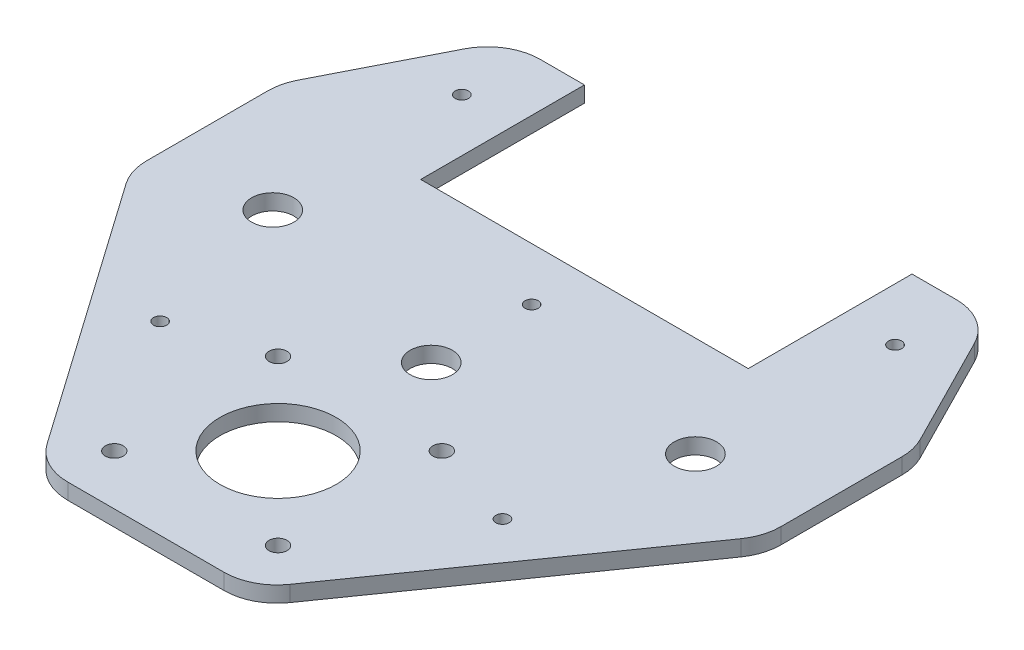
ISO-10303-21;
HEADER;
FILE_DESCRIPTION(('STEP AP214'),'2;1');
FILE_NAME('part.step','',(''),(''),'','','');
FILE_SCHEMA(('AUTOMOTIVE_DESIGN { 1 0 10303 214 1 1 1 1 }'));
ENDSEC;
DATA;
#1=APPLICATION_CONTEXT('core data for automotive mechanical design processes');
#2=APPLICATION_PROTOCOL_DEFINITION('international standard','automotive_design',2000,#1);
#3=PRODUCT_CONTEXT('',#1,'mechanical');
#4=PRODUCT('Part','Part','',(#3));
#5=PRODUCT_RELATED_PRODUCT_CATEGORY('part','',(#4));
#6=PRODUCT_DEFINITION_FORMATION('','',#4);
#7=PRODUCT_DEFINITION_CONTEXT('part definition',#1,'design');
#8=PRODUCT_DEFINITION('design','',#6,#7);
#9=PRODUCT_DEFINITION_SHAPE('','',#8);
#10=(LENGTH_UNIT() NAMED_UNIT(*) SI_UNIT(.MILLI.,.METRE.));
#11=(NAMED_UNIT(*) PLANE_ANGLE_UNIT() SI_UNIT($,.RADIAN.));
#12=(NAMED_UNIT(*) SI_UNIT($,.STERADIAN.) SOLID_ANGLE_UNIT());
#13=UNCERTAINTY_MEASURE_WITH_UNIT(LENGTH_MEASURE(1.E-05),#10,'distance_accuracy_value','');
#14=(GEOMETRIC_REPRESENTATION_CONTEXT(3) GLOBAL_UNCERTAINTY_ASSIGNED_CONTEXT((#13)) GLOBAL_UNIT_ASSIGNED_CONTEXT((#10,
#11,#12)) REPRESENTATION_CONTEXT('',''));
#15=CARTESIAN_POINT('',(0.,0.,0.));
#16=DIRECTION('',(0.,0.,1.));
#17=DIRECTION('',(1.,0.,0.));
#18=AXIS2_PLACEMENT_3D('',#15,#16,#17);
#19=CARTESIAN_POINT('',(0.,3.,0.));
#20=DIRECTION('',(0.,-1.,0.));
#21=DIRECTION('',(0.,0.,-1.));
#22=AXIS2_PLACEMENT_3D('',#19,#20,#21);
#23=PLANE('',#22);
#24=CARTESIAN_POINT('',(32.4004595233145,3.,28.9206548207232));
#25=DIRECTION('',(0.,1.,0.));
#26=DIRECTION('',(0.,0.,1.));
#27=AXIS2_PLACEMENT_3D('',#24,#25,#26);
#28=CIRCLE('',#27,1.25);
#29=CARTESIAN_POINT('',(32.4004595233145,3.,30.1706548207232));
#30=VERTEX_POINT('',#29);
#31=EDGE_CURVE('E427',#30,#30,#28,.T.);
#32=ORIENTED_EDGE('',*,*,#31,.F.);
#33=EDGE_LOOP('',(#32));
#34=FACE_BOUND('',#33,.T.);
#35=CARTESIAN_POINT('',(0.,3.,-9.00000000000001));
#36=DIRECTION('',(0.,1.,0.));
#37=DIRECTION('',(0.,0.,1.));
#38=AXIS2_PLACEMENT_3D('',#35,#36,#37);
#39=CIRCLE('',#38,1.25);
#40=CARTESIAN_POINT('',(0.,3.,-7.75000000000001));
#41=VERTEX_POINT('',#40);
#42=EDGE_CURVE('E421',#41,#41,#39,.T.);
#43=ORIENTED_EDGE('',*,*,#42,.F.);
#44=EDGE_LOOP('',(#43));
#45=FACE_BOUND('',#44,.T.);
#46=CARTESIAN_POINT('',(-41.,3.,-36.7920317857662));
#47=DIRECTION('',(0.,1.,0.));
#48=DIRECTION('',(0.,0.,1.));
#49=AXIS2_PLACEMENT_3D('',#46,#47,#48);
#50=CIRCLE('',#49,1.25);
#51=CARTESIAN_POINT('',(-41.,3.,-35.5420317857662));
#52=VERTEX_POINT('',#51);
#53=EDGE_CURVE('E415',#52,#52,#50,.T.);
#54=ORIENTED_EDGE('',*,*,#53,.F.);
#55=EDGE_LOOP('',(#54));
#56=FACE_BOUND('',#55,.T.);
#57=CARTESIAN_POINT('',(41.,3.,-36.7920317857662));
#58=DIRECTION('',(0.,1.,0.));
#59=DIRECTION('',(0.,0.,1.));
#60=AXIS2_PLACEMENT_3D('',#57,#58,#59);
#61=CIRCLE('',#60,1.25555555555556);
#62=CARTESIAN_POINT('',(41.,3.,-35.5364762302107));
#63=VERTEX_POINT('',#62);
#64=EDGE_CURVE('E409',#63,#63,#61,.T.);
#65=ORIENTED_EDGE('',*,*,#64,.F.);
#66=EDGE_LOOP('',(#65));
#67=FACE_BOUND('',#66,.T.);
#68=CARTESIAN_POINT('',(-32.4004595233145,3.,28.9206548207232));
#69=DIRECTION('',(0.,1.,0.));
#70=DIRECTION('',(0.,0.,1.));
#71=AXIS2_PLACEMENT_3D('',#68,#69,#70);
#72=CIRCLE('',#71,1.25);
#73=CARTESIAN_POINT('',(-32.4004595233145,3.,30.1706548207232));
#74=VERTEX_POINT('',#73);
#75=EDGE_CURVE('E403',#74,#74,#72,.T.);
#76=ORIENTED_EDGE('',*,*,#75,.F.);
#77=EDGE_LOOP('',(#76));
#78=FACE_BOUND('',#77,.T.);
#79=DIRECTION('',(-1.,0.,0.));
#80=VECTOR('',#79,1.);
#81=CARTESIAN_POINT('',(-31.,3.,-50.));
#82=LINE('',#81,#80);
#83=CARTESIAN_POINT('',(-31.,3.,-50.));
#84=VERTEX_POINT('',#83);
#85=CARTESIAN_POINT('',(-39.3678758208284,3.,-50.));
#86=VERTEX_POINT('',#85);
#87=EDGE_CURVE('E237',#84,#86,#82,.T.);
#88=ORIENTED_EDGE('',*,*,#87,.T.);
#89=CARTESIAN_POINT('',(-39.3678758208284,3.,-40.));
#90=DIRECTION('',(0.,-1.,0.));
#91=DIRECTION('',(0.,0.,-1.));
#92=AXIS2_PLACEMENT_3D('',#89,#90,#91);
#93=CIRCLE('',#92,10.);
#94=CARTESIAN_POINT('',(-48.2806561284393,3.,-44.5345724372055));
#95=VERTEX_POINT('',#94);
#96=EDGE_CURVE('E279',#86,#95,#93,.F.);
#97=ORIENTED_EDGE('',*,*,#96,.T.);
#98=DIRECTION('',(-0.453457243720553,0.,0.891278030761086));
#99=VECTOR('',#98,1.);
#100=CARTESIAN_POINT('',(-60.,3.,-21.5));
#101=LINE('',#100,#99);
#102=CARTESIAN_POINT('',(-58.9127803076108,3.,-23.636949050558));
#103=VERTEX_POINT('',#102);
#104=EDGE_CURVE('E351',#95,#103,#101,.T.);
#105=ORIENTED_EDGE('',*,*,#104,.T.);
#106=CARTESIAN_POINT('',(-50.,3.,-19.1023766133524));
#107=DIRECTION('',(0.,-1.,0.));
#108=DIRECTION('',(0.,0.,-1.));
#109=AXIS2_PLACEMENT_3D('',#106,#107,#108);
#110=CIRCLE('',#109,10.);
#111=CARTESIAN_POINT('',(-60.,3.,-19.1023766133524));
#112=VERTEX_POINT('',#111);
#113=EDGE_CURVE('E277',#103,#112,#110,.F.);
#114=ORIENTED_EDGE('',*,*,#113,.T.);
#115=DIRECTION('',(0.,0.,1.));
#116=VECTOR('',#115,1.);
#117=CARTESIAN_POINT('',(-60.,3.,7.00000000000001));
#118=LINE('',#117,#116);
#119=CARTESIAN_POINT('',(-60.,3.,3.84130964144633));
#120=VERTEX_POINT('',#119);
#121=EDGE_CURVE('E348',#112,#120,#118,.T.);
#122=ORIENTED_EDGE('',*,*,#121,.T.);
#123=CARTESIAN_POINT('',(-50.,3.,3.84130964144633));
#124=DIRECTION('',(0.,-1.,0.));
#125=DIRECTION('',(0.,0.,-1.));
#126=AXIS2_PLACEMENT_3D('',#123,#124,#125);
#127=CIRCLE('',#126,10.);
#128=CARTESIAN_POINT('',(-58.1855669246241,3.,9.58556713241063));
#129=VERTEX_POINT('',#128);
#130=EDGE_CURVE('E275',#120,#129,#127,.F.);
#131=ORIENTED_EDGE('',*,*,#130,.T.);
#132=DIRECTION('',(0.57442574909643,0.,0.818556692462413));
#133=VECTOR('',#132,1.);
#134=CARTESIAN_POINT('',(-60.,3.,7.00000000000001));
#135=LINE('',#134,#133);
#136=CARTESIAN_POINT('',(-22.9864859712531,3.,59.7442574909643));
#137=VERTEX_POINT('',#136);
#138=EDGE_CURVE('E321',#129,#137,#135,.T.);
#139=ORIENTED_EDGE('',*,*,#138,.T.);
#140=CARTESIAN_POINT('',(-14.800919046629,3.,54.));
#141=DIRECTION('',(0.,-1.,0.));
#142=DIRECTION('',(0.,0.,-1.));
#143=AXIS2_PLACEMENT_3D('',#140,#141,#142);
#144=CIRCLE('',#143,10.);
#145=CARTESIAN_POINT('',(-14.800919046629,3.,64.));
#146=VERTEX_POINT('',#145);
#147=EDGE_CURVE('E268',#137,#146,#144,.F.);
#148=ORIENTED_EDGE('',*,*,#147,.T.);
#149=DIRECTION('',(1.,0.,0.));
#150=VECTOR('',#149,1.);
#151=CARTESIAN_POINT('',(20.,3.,64.));
#152=LINE('',#151,#150);
#153=CARTESIAN_POINT('',(14.800919046629,3.,64.));
#154=VERTEX_POINT('',#153);
#155=EDGE_CURVE('E311',#146,#154,#152,.T.);
#156=ORIENTED_EDGE('',*,*,#155,.T.);
#157=CARTESIAN_POINT('',(14.800919046629,3.,54.));
#158=DIRECTION('',(0.,-1.,0.));
#159=DIRECTION('',(0.,0.,-1.));
#160=AXIS2_PLACEMENT_3D('',#157,#158,#159);
#161=CIRCLE('',#160,10.);
#162=CARTESIAN_POINT('',(22.9864859712531,3.,59.7442574909643));
#163=VERTEX_POINT('',#162);
#164=EDGE_CURVE('E266',#154,#163,#161,.F.);
#165=ORIENTED_EDGE('',*,*,#164,.T.);
#166=DIRECTION('',(0.57442574909643,0.,-0.818556692462413));
#167=VECTOR('',#166,1.);
#168=CARTESIAN_POINT('',(20.,3.,64.));
#169=LINE('',#168,#167);
#170=CARTESIAN_POINT('',(58.1855669246241,3.,9.58556713241062));
#171=VERTEX_POINT('',#170);
#172=EDGE_CURVE('E320',#163,#171,#169,.T.);
#173=ORIENTED_EDGE('',*,*,#172,.T.);
#174=CARTESIAN_POINT('',(50.,3.,3.84130964144631));
#175=DIRECTION('',(0.,-1.,0.));
#176=DIRECTION('',(0.,0.,-1.));
#177=AXIS2_PLACEMENT_3D('',#174,#175,#176);
#178=CIRCLE('',#177,10.);
#179=CARTESIAN_POINT('',(60.,3.,3.84130964144631));
#180=VERTEX_POINT('',#179);
#181=EDGE_CURVE('E270',#171,#180,#178,.F.);
#182=ORIENTED_EDGE('',*,*,#181,.T.);
#183=DIRECTION('',(0.,0.,-1.));
#184=VECTOR('',#183,1.);
#185=CARTESIAN_POINT('',(60.,3.,7.00000000000001));
#186=LINE('',#185,#184);
#187=CARTESIAN_POINT('',(60.,3.,-19.1023766133524));
#188=VERTEX_POINT('',#187);
#189=EDGE_CURVE('E342',#180,#188,#186,.T.);
#190=ORIENTED_EDGE('',*,*,#189,.T.);
#191=CARTESIAN_POINT('',(50.,3.,-19.1023766133524));
#192=DIRECTION('',(0.,-1.,0.));
#193=DIRECTION('',(0.,0.,-1.));
#194=AXIS2_PLACEMENT_3D('',#191,#192,#193);
#195=CIRCLE('',#194,10.);
#196=CARTESIAN_POINT('',(58.9127803076109,3.,-23.636949050558));
#197=VERTEX_POINT('',#196);
#198=EDGE_CURVE('E272',#188,#197,#195,.F.);
#199=ORIENTED_EDGE('',*,*,#198,.T.);
#200=DIRECTION('',(-0.453457243720553,0.,-0.891278030761086));
#201=VECTOR('',#200,1.);
#202=CARTESIAN_POINT('',(45.5,3.,-50.));
#203=LINE('',#202,#201);
#204=CARTESIAN_POINT('',(48.2806561284393,3.,-44.5345724372055));
#205=VERTEX_POINT('',#204);
#206=EDGE_CURVE('E183',#197,#205,#203,.T.);
#207=ORIENTED_EDGE('',*,*,#206,.T.);
#208=CARTESIAN_POINT('',(39.3678758208284,3.,-40.));
#209=DIRECTION('',(0.,-1.,0.));
#210=DIRECTION('',(0.,0.,-1.));
#211=AXIS2_PLACEMENT_3D('',#208,#209,#210);
#212=CIRCLE('',#211,10.);
#213=CARTESIAN_POINT('',(39.3678758208284,3.,-50.));
#214=VERTEX_POINT('',#213);
#215=EDGE_CURVE('E52',#205,#214,#212,.F.);
#216=ORIENTED_EDGE('',*,*,#215,.T.);
#217=DIRECTION('',(-1.,0.,0.));
#218=VECTOR('',#217,1.);
#219=CARTESIAN_POINT('',(45.5,3.,-50.));
#220=LINE('',#219,#218);
#221=CARTESIAN_POINT('',(31.,3.,-50.));
#222=VERTEX_POINT('',#221);
#223=EDGE_CURVE('E173',#214,#222,#220,.T.);
#224=ORIENTED_EDGE('',*,*,#223,.T.);
#225=DIRECTION('',(0.,0.,1.));
#226=VECTOR('',#225,1.);
#227=CARTESIAN_POINT('',(31.,3.,-50.));
#228=LINE('',#227,#226);
#229=CARTESIAN_POINT('',(31.,3.,-19.));
#230=VERTEX_POINT('',#229);
#231=EDGE_CURVE('E178',#222,#230,#228,.T.);
#232=ORIENTED_EDGE('',*,*,#231,.T.);
#233=DIRECTION('',(-1.,0.,0.));
#234=VECTOR('',#233,1.);
#235=CARTESIAN_POINT('',(31.,3.,-19.));
#236=LINE('',#235,#234);
#237=CARTESIAN_POINT('',(-31.,3.,-19.));
#238=VERTEX_POINT('',#237);
#239=EDGE_CURVE('E198',#230,#238,#236,.T.);
#240=ORIENTED_EDGE('',*,*,#239,.T.);
#241=DIRECTION('',(0.,0.,-1.));
#242=VECTOR('',#241,1.);
#243=CARTESIAN_POINT('',(-31.,3.,-50.));
#244=LINE('',#243,#242);
#245=EDGE_CURVE('E200',#238,#84,#244,.T.);
#246=ORIENTED_EDGE('',*,*,#245,.T.);
#247=EDGE_LOOP('',(#88,#97,#105,#114,#122,#131,#139,#148,#156,#165,#173,#182,#190,#199,#207,
#216,#224,#232,#240,#246));
#248=FACE_BOUND('',#247,.T.);
#249=CARTESIAN_POINT('',(0.,3.,39.));
#250=DIRECTION('',(0.,1.,0.));
#251=DIRECTION('',(0.,0.,1.));
#252=AXIS2_PLACEMENT_3D('',#249,#250,#251);
#253=CIRCLE('',#252,11.);
#254=CARTESIAN_POINT('',(0.,3.,50.));
#255=VERTEX_POINT('',#254);
#256=EDGE_CURVE('E210',#255,#255,#253,.T.);
#257=ORIENTED_EDGE('',*,*,#256,.F.);
#258=EDGE_LOOP('',(#257));
#259=FACE_BOUND('',#258,.T.);
#260=CARTESIAN_POINT('',(0.,3.,9.99999999999999));
#261=DIRECTION('',(0.,1.,0.));
#262=DIRECTION('',(0.,0.,1.));
#263=AXIS2_PLACEMENT_3D('',#260,#261,#262);
#264=CIRCLE('',#263,4.);
#265=CARTESIAN_POINT('',(0.,3.,14.));
#266=VERTEX_POINT('',#265);
#267=EDGE_CURVE('E358',#266,#266,#264,.T.);
#268=ORIENTED_EDGE('',*,*,#267,.F.);
#269=EDGE_LOOP('',(#268));
#270=FACE_BOUND('',#269,.T.);
#271=CARTESIAN_POINT('',(-40.,3.,0.));
#272=DIRECTION('',(0.,1.,0.));
#273=DIRECTION('',(0.,0.,1.));
#274=AXIS2_PLACEMENT_3D('',#271,#272,#273);
#275=CIRCLE('',#274,4.00000000000001);
#276=CARTESIAN_POINT('',(-40.,3.,4.));
#277=VERTEX_POINT('',#276);
#278=EDGE_CURVE('E364',#277,#277,#275,.T.);
#279=ORIENTED_EDGE('',*,*,#278,.F.);
#280=EDGE_LOOP('',(#279));
#281=FACE_BOUND('',#280,.T.);
#282=CARTESIAN_POINT('',(40.,3.,0.));
#283=DIRECTION('',(0.,1.,0.));
#284=DIRECTION('',(0.,0.,1.));
#285=AXIS2_PLACEMENT_3D('',#282,#283,#284);
#286=CIRCLE('',#285,4.00000000000001);
#287=CARTESIAN_POINT('',(40.,3.,3.99999999999999));
#288=VERTEX_POINT('',#287);
#289=EDGE_CURVE('E370',#288,#288,#286,.T.);
#290=ORIENTED_EDGE('',*,*,#289,.F.);
#291=EDGE_LOOP('',(#290));
#292=FACE_BOUND('',#291,.T.);
#293=CARTESIAN_POINT('',(-15.5,3.,23.5));
#294=DIRECTION('',(0.,1.,0.));
#295=DIRECTION('',(0.,0.,1.));
#296=AXIS2_PLACEMENT_3D('',#293,#294,#295);
#297=CIRCLE('',#296,1.7);
#298=CARTESIAN_POINT('',(-15.5,3.,25.2));
#299=VERTEX_POINT('',#298);
#300=EDGE_CURVE('E376',#299,#299,#297,.T.);
#301=ORIENTED_EDGE('',*,*,#300,.F.);
#302=EDGE_LOOP('',(#301));
#303=FACE_BOUND('',#302,.T.);
#304=CARTESIAN_POINT('',(15.5,3.,23.5));
#305=DIRECTION('',(0.,1.,0.));
#306=DIRECTION('',(0.,0.,1.));
#307=AXIS2_PLACEMENT_3D('',#304,#305,#306);
#308=CIRCLE('',#307,1.7);
#309=CARTESIAN_POINT('',(15.5,3.,25.2));
#310=VERTEX_POINT('',#309);
#311=EDGE_CURVE('E382',#310,#310,#308,.T.);
#312=ORIENTED_EDGE('',*,*,#311,.F.);
#313=EDGE_LOOP('',(#312));
#314=FACE_BOUND('',#313,.T.);
#315=CARTESIAN_POINT('',(15.5,3.,54.5));
#316=DIRECTION('',(0.,1.,0.));
#317=DIRECTION('',(0.,0.,1.));
#318=AXIS2_PLACEMENT_3D('',#315,#316,#317);
#319=CIRCLE('',#318,1.7);
#320=CARTESIAN_POINT('',(15.5,3.,56.2));
#321=VERTEX_POINT('',#320);
#322=EDGE_CURVE('E388',#321,#321,#319,.T.);
#323=ORIENTED_EDGE('',*,*,#322,.F.);
#324=EDGE_LOOP('',(#323));
#325=FACE_BOUND('',#324,.T.);
#326=CARTESIAN_POINT('',(-15.5,3.,54.5));
#327=DIRECTION('',(0.,1.,0.));
#328=DIRECTION('',(0.,0.,1.));
#329=AXIS2_PLACEMENT_3D('',#326,#327,#328);
#330=CIRCLE('',#329,1.7);
#331=CARTESIAN_POINT('',(-15.5,3.,56.2));
#332=VERTEX_POINT('',#331);
#333=EDGE_CURVE('E394',#332,#332,#330,.T.);
#334=ORIENTED_EDGE('',*,*,#333,.F.);
#335=EDGE_LOOP('',(#334));
#336=FACE_BOUND('',#335,.T.);
#337=ADVANCED_FACE('F37',(#34,#45,#56,#67,#78,#248,#259,#270,#281,#292,#303,#314,#325,#336),#23,.F.);
#338=CARTESIAN_POINT('',(0.,0.,0.));
#339=DIRECTION('',(0.,-1.,0.));
#340=DIRECTION('',(0.,0.,-1.));
#341=AXIS2_PLACEMENT_3D('',#338,#339,#340);
#342=PLANE('',#341);
#343=CARTESIAN_POINT('',(32.4004595233145,0.,28.9206548207232));
#344=DIRECTION('',(0.,1.,0.));
#345=DIRECTION('',(0.,0.,1.));
#346=AXIS2_PLACEMENT_3D('',#343,#344,#345);
#347=CIRCLE('',#346,1.25);
#348=CARTESIAN_POINT('',(32.4004595233145,0.,30.1706548207232));
#349=VERTEX_POINT('',#348);
#350=EDGE_CURVE('E406',#349,#349,#347,.T.);
#351=ORIENTED_EDGE('',*,*,#350,.T.);
#352=EDGE_LOOP('',(#351));
#353=FACE_BOUND('',#352,.T.);
#354=CARTESIAN_POINT('',(0.,0.,-9.00000000000001));
#355=DIRECTION('',(0.,1.,0.));
#356=DIRECTION('',(0.,0.,1.));
#357=AXIS2_PLACEMENT_3D('',#354,#355,#356);
#358=CIRCLE('',#357,1.25);
#359=CARTESIAN_POINT('',(0.,0.,-7.75000000000001));
#360=VERTEX_POINT('',#359);
#361=EDGE_CURVE('E424',#360,#360,#358,.T.);
#362=ORIENTED_EDGE('',*,*,#361,.T.);
#363=EDGE_LOOP('',(#362));
#364=FACE_BOUND('',#363,.T.);
#365=CARTESIAN_POINT('',(-41.,0.,-36.7920317857662));
#366=DIRECTION('',(0.,1.,0.));
#367=DIRECTION('',(0.,0.,1.));
#368=AXIS2_PLACEMENT_3D('',#365,#366,#367);
#369=CIRCLE('',#368,1.25);
#370=CARTESIAN_POINT('',(-41.,0.,-35.5420317857662));
#371=VERTEX_POINT('',#370);
#372=EDGE_CURVE('E418',#371,#371,#369,.T.);
#373=ORIENTED_EDGE('',*,*,#372,.T.);
#374=EDGE_LOOP('',(#373));
#375=FACE_BOUND('',#374,.T.);
#376=CARTESIAN_POINT('',(41.,0.,-36.7920317857662));
#377=DIRECTION('',(0.,1.,0.));
#378=DIRECTION('',(0.,0.,1.));
#379=AXIS2_PLACEMENT_3D('',#376,#377,#378);
#380=CIRCLE('',#379,1.25555555555556);
#381=CARTESIAN_POINT('',(41.,0.,-35.5364762302107));
#382=VERTEX_POINT('',#381);
#383=EDGE_CURVE('E412',#382,#382,#380,.T.);
#384=ORIENTED_EDGE('',*,*,#383,.T.);
#385=EDGE_LOOP('',(#384));
#386=FACE_BOUND('',#385,.T.);
#387=CARTESIAN_POINT('',(-32.4004595233145,0.,28.9206548207232));
#388=DIRECTION('',(0.,1.,0.));
#389=DIRECTION('',(0.,0.,1.));
#390=AXIS2_PLACEMENT_3D('',#387,#388,#389);
#391=CIRCLE('',#390,1.25);
#392=CARTESIAN_POINT('',(-32.4004595233145,0.,30.1706548207232));
#393=VERTEX_POINT('',#392);
#394=EDGE_CURVE('E400',#393,#393,#391,.T.);
#395=ORIENTED_EDGE('',*,*,#394,.T.);
#396=EDGE_LOOP('',(#395));
#397=FACE_BOUND('',#396,.T.);
#398=CARTESIAN_POINT('',(15.5,0.,54.5));
#399=DIRECTION('',(0.,1.,0.));
#400=DIRECTION('',(0.,0.,1.));
#401=AXIS2_PLACEMENT_3D('',#398,#399,#400);
#402=CIRCLE('',#401,1.7);
#403=CARTESIAN_POINT('',(15.5,0.,56.2));
#404=VERTEX_POINT('',#403);
#405=EDGE_CURVE('E391',#404,#404,#402,.T.);
#406=ORIENTED_EDGE('',*,*,#405,.T.);
#407=EDGE_LOOP('',(#406));
#408=FACE_BOUND('',#407,.T.);
#409=CARTESIAN_POINT('',(-15.5,0.,23.5));
#410=DIRECTION('',(0.,1.,0.));
#411=DIRECTION('',(0.,0.,1.));
#412=AXIS2_PLACEMENT_3D('',#409,#410,#411);
#413=CIRCLE('',#412,1.7);
#414=CARTESIAN_POINT('',(-15.5,0.,25.2));
#415=VERTEX_POINT('',#414);
#416=EDGE_CURVE('E379',#415,#415,#413,.T.);
#417=ORIENTED_EDGE('',*,*,#416,.T.);
#418=EDGE_LOOP('',(#417));
#419=FACE_BOUND('',#418,.T.);
#420=CARTESIAN_POINT('',(-40.,0.,0.));
#421=DIRECTION('',(0.,1.,0.));
#422=DIRECTION('',(0.,0.,1.));
#423=AXIS2_PLACEMENT_3D('',#420,#421,#422);
#424=CIRCLE('',#423,4.00000000000001);
#425=CARTESIAN_POINT('',(-40.,0.,4.));
#426=VERTEX_POINT('',#425);
#427=EDGE_CURVE('E367',#426,#426,#424,.T.);
#428=ORIENTED_EDGE('',*,*,#427,.T.);
#429=EDGE_LOOP('',(#428));
#430=FACE_BOUND('',#429,.T.);
#431=CARTESIAN_POINT('',(0.,0.,39.));
#432=DIRECTION('',(0.,1.,0.));
#433=DIRECTION('',(0.,0.,1.));
#434=AXIS2_PLACEMENT_3D('',#431,#432,#433);
#435=CIRCLE('',#434,11.);
#436=CARTESIAN_POINT('',(0.,0.,50.));
#437=VERTEX_POINT('',#436);
#438=EDGE_CURVE('E355',#437,#437,#435,.T.);
#439=ORIENTED_EDGE('',*,*,#438,.T.);
#440=EDGE_LOOP('',(#439));
#441=FACE_BOUND('',#440,.T.);
#442=DIRECTION('',(-0.453457243720553,0.,0.891278030761086));
#443=VECTOR('',#442,1.);
#444=CARTESIAN_POINT('',(-60.,0.,-21.5));
#445=LINE('',#444,#443);
#446=CARTESIAN_POINT('',(-48.2806561284393,0.,-44.5345724372055));
#447=VERTEX_POINT('',#446);
#448=CARTESIAN_POINT('',(-58.9127803076108,0.,-23.636949050558));
#449=VERTEX_POINT('',#448);
#450=EDGE_CURVE('E209',#447,#449,#445,.T.);
#451=ORIENTED_EDGE('',*,*,#450,.F.);
#452=CARTESIAN_POINT('',(-39.3678758208284,0.,-40.));
#453=DIRECTION('',(0.,-1.,0.));
#454=DIRECTION('',(0.,0.,-1.));
#455=AXIS2_PLACEMENT_3D('',#452,#453,#454);
#456=CIRCLE('',#455,10.);
#457=CARTESIAN_POINT('',(-39.3678758208284,0.,-50.));
#458=VERTEX_POINT('',#457);
#459=EDGE_CURVE('E262',#447,#458,#456,.T.);
#460=ORIENTED_EDGE('',*,*,#459,.T.);
#461=DIRECTION('',(-1.,0.,0.));
#462=VECTOR('',#461,1.);
#463=CARTESIAN_POINT('',(-31.,0.,-50.));
#464=LINE('',#463,#462);
#465=CARTESIAN_POINT('',(-31.,0.,-50.));
#466=VERTEX_POINT('',#465);
#467=EDGE_CURVE('E206',#466,#458,#464,.T.);
#468=ORIENTED_EDGE('',*,*,#467,.F.);
#469=DIRECTION('',(0.,0.,-1.));
#470=VECTOR('',#469,1.);
#471=CARTESIAN_POINT('',(-31.,0.,-50.));
#472=LINE('',#471,#470);
#473=CARTESIAN_POINT('',(-31.,0.,-19.));
#474=VERTEX_POINT('',#473);
#475=EDGE_CURVE('E235',#474,#466,#472,.T.);
#476=ORIENTED_EDGE('',*,*,#475,.F.);
#477=DIRECTION('',(-1.,0.,0.));
#478=VECTOR('',#477,1.);
#479=CARTESIAN_POINT('',(31.,0.,-19.));
#480=LINE('',#479,#478);
#481=CARTESIAN_POINT('',(31.,0.,-19.));
#482=VERTEX_POINT('',#481);
#483=EDGE_CURVE('E233',#482,#474,#480,.T.);
#484=ORIENTED_EDGE('',*,*,#483,.F.);
#485=DIRECTION('',(0.,0.,1.));
#486=VECTOR('',#485,1.);
#487=CARTESIAN_POINT('',(31.,0.,-50.));
#488=LINE('',#487,#486);
#489=CARTESIAN_POINT('',(31.,0.,-50.));
#490=VERTEX_POINT('',#489);
#491=EDGE_CURVE('E231',#490,#482,#488,.T.);
#492=ORIENTED_EDGE('',*,*,#491,.F.);
#493=DIRECTION('',(-1.,0.,0.));
#494=VECTOR('',#493,1.);
#495=CARTESIAN_POINT('',(45.5,0.,-50.));
#496=LINE('',#495,#494);
#497=CARTESIAN_POINT('',(39.3678758208284,0.,-50.));
#498=VERTEX_POINT('',#497);
#499=EDGE_CURVE('E189',#498,#490,#496,.T.);
#500=ORIENTED_EDGE('',*,*,#499,.F.);
#501=CARTESIAN_POINT('',(39.3678758208284,0.,-40.));
#502=DIRECTION('',(0.,-1.,0.));
#503=DIRECTION('',(0.,0.,-1.));
#504=AXIS2_PLACEMENT_3D('',#501,#502,#503);
#505=CIRCLE('',#504,10.);
#506=CARTESIAN_POINT('',(48.2806561284393,0.,-44.5345724372055));
#507=VERTEX_POINT('',#506);
#508=EDGE_CURVE('E256',#498,#507,#505,.T.);
#509=ORIENTED_EDGE('',*,*,#508,.T.);
#510=DIRECTION('',(-0.453457243720553,0.,-0.891278030761086));
#511=VECTOR('',#510,1.);
#512=CARTESIAN_POINT('',(45.5,0.,-50.));
#513=LINE('',#512,#511);
#514=CARTESIAN_POINT('',(58.9127803076109,0.,-23.636949050558));
#515=VERTEX_POINT('',#514);
#516=EDGE_CURVE('E228',#515,#507,#513,.T.);
#517=ORIENTED_EDGE('',*,*,#516,.F.);
#518=CARTESIAN_POINT('',(50.,0.,-19.1023766133524));
#519=DIRECTION('',(0.,-1.,0.));
#520=DIRECTION('',(0.,0.,-1.));
#521=AXIS2_PLACEMENT_3D('',#518,#519,#520);
#522=CIRCLE('',#521,10.);
#523=CARTESIAN_POINT('',(60.,0.,-19.1023766133524));
#524=VERTEX_POINT('',#523);
#525=EDGE_CURVE('E254',#515,#524,#522,.T.);
#526=ORIENTED_EDGE('',*,*,#525,.T.);
#527=DIRECTION('',(0.,0.,-1.));
#528=VECTOR('',#527,1.);
#529=CARTESIAN_POINT('',(60.,0.,7.00000000000001));
#530=LINE('',#529,#528);
#531=CARTESIAN_POINT('',(60.,0.,3.84130964144631));
#532=VERTEX_POINT('',#531);
#533=EDGE_CURVE('E225',#532,#524,#530,.T.);
#534=ORIENTED_EDGE('',*,*,#533,.F.);
#535=CARTESIAN_POINT('',(50.,0.,3.84130964144631));
#536=DIRECTION('',(0.,-1.,0.));
#537=DIRECTION('',(0.,0.,-1.));
#538=AXIS2_PLACEMENT_3D('',#535,#536,#537);
#539=CIRCLE('',#538,10.);
#540=CARTESIAN_POINT('',(58.1855669246241,0.,9.58556713241062));
#541=VERTEX_POINT('',#540);
#542=EDGE_CURVE('E252',#532,#541,#539,.T.);
#543=ORIENTED_EDGE('',*,*,#542,.T.);
#544=DIRECTION('',(0.57442574909643,0.,-0.818556692462413));
#545=VECTOR('',#544,1.);
#546=CARTESIAN_POINT('',(20.,0.,64.));
#547=LINE('',#546,#545);
#548=CARTESIAN_POINT('',(22.9864859712531,0.,59.7442574909643));
#549=VERTEX_POINT('',#548);
#550=EDGE_CURVE('E222',#549,#541,#547,.T.);
#551=ORIENTED_EDGE('',*,*,#550,.F.);
#552=CARTESIAN_POINT('',(14.800919046629,0.,54.));
#553=DIRECTION('',(0.,-1.,0.));
#554=DIRECTION('',(0.,0.,-1.));
#555=AXIS2_PLACEMENT_3D('',#552,#553,#554);
#556=CIRCLE('',#555,10.);
#557=CARTESIAN_POINT('',(14.800919046629,0.,64.));
#558=VERTEX_POINT('',#557);
#559=EDGE_CURVE('E248',#549,#558,#556,.T.);
#560=ORIENTED_EDGE('',*,*,#559,.T.);
#561=DIRECTION('',(1.,0.,0.));
#562=VECTOR('',#561,1.);
#563=CARTESIAN_POINT('',(20.,0.,64.));
#564=LINE('',#563,#562);
#565=CARTESIAN_POINT('',(-14.800919046629,0.,64.));
#566=VERTEX_POINT('',#565);
#567=EDGE_CURVE('E219',#566,#558,#564,.T.);
#568=ORIENTED_EDGE('',*,*,#567,.F.);
#569=CARTESIAN_POINT('',(-14.800919046629,0.,54.));
#570=DIRECTION('',(0.,-1.,0.));
#571=DIRECTION('',(0.,0.,-1.));
#572=AXIS2_PLACEMENT_3D('',#569,#570,#571);
#573=CIRCLE('',#572,10.);
#574=CARTESIAN_POINT('',(-22.9864859712531,0.,59.7442574909643));
#575=VERTEX_POINT('',#574);
#576=EDGE_CURVE('E250',#566,#575,#573,.T.);
#577=ORIENTED_EDGE('',*,*,#576,.T.);
#578=DIRECTION('',(0.57442574909643,0.,0.818556692462413));
#579=VECTOR('',#578,1.);
#580=CARTESIAN_POINT('',(-60.,0.,7.00000000000001));
#581=LINE('',#580,#579);
#582=CARTESIAN_POINT('',(-58.1855669246241,0.,9.58556713241063));
#583=VERTEX_POINT('',#582);
#584=EDGE_CURVE('E216',#583,#575,#581,.T.);
#585=ORIENTED_EDGE('',*,*,#584,.F.);
#586=CARTESIAN_POINT('',(-50.,0.,3.84130964144633));
#587=DIRECTION('',(0.,-1.,0.));
#588=DIRECTION('',(0.,0.,-1.));
#589=AXIS2_PLACEMENT_3D('',#586,#587,#588);
#590=CIRCLE('',#589,10.);
#591=CARTESIAN_POINT('',(-60.,0.,3.84130964144633));
#592=VERTEX_POINT('',#591);
#593=EDGE_CURVE('E258',#583,#592,#590,.T.);
#594=ORIENTED_EDGE('',*,*,#593,.T.);
#595=DIRECTION('',(0.,0.,1.));
#596=VECTOR('',#595,1.);
#597=CARTESIAN_POINT('',(-60.,0.,7.00000000000001));
#598=LINE('',#597,#596);
#599=CARTESIAN_POINT('',(-60.,0.,-19.1023766133524));
#600=VERTEX_POINT('',#599);
#601=EDGE_CURVE('E213',#600,#592,#598,.T.);
#602=ORIENTED_EDGE('',*,*,#601,.F.);
#603=CARTESIAN_POINT('',(-50.,0.,-19.1023766133524));
#604=DIRECTION('',(0.,-1.,0.));
#605=DIRECTION('',(0.,0.,-1.));
#606=AXIS2_PLACEMENT_3D('',#603,#604,#605);
#607=CIRCLE('',#606,10.);
#608=EDGE_CURVE('E260',#600,#449,#607,.T.);
#609=ORIENTED_EDGE('',*,*,#608,.T.);
#610=EDGE_LOOP('',(#451,#460,#468,#476,#484,#492,#500,#509,#517,#526,#534,#543,#551,#560,#568,
#577,#585,#594,#602,#609));
#611=FACE_BOUND('',#610,.T.);
#612=CARTESIAN_POINT('',(0.,0.,9.99999999999999));
#613=DIRECTION('',(0.,1.,0.));
#614=DIRECTION('',(0.,0.,1.));
#615=AXIS2_PLACEMENT_3D('',#612,#613,#614);
#616=CIRCLE('',#615,4.);
#617=CARTESIAN_POINT('',(0.,0.,14.));
#618=VERTEX_POINT('',#617);
#619=EDGE_CURVE('E361',#618,#618,#616,.T.);
#620=ORIENTED_EDGE('',*,*,#619,.T.);
#621=EDGE_LOOP('',(#620));
#622=FACE_BOUND('',#621,.T.);
#623=CARTESIAN_POINT('',(40.,0.,0.));
#624=DIRECTION('',(0.,1.,0.));
#625=DIRECTION('',(0.,0.,1.));
#626=AXIS2_PLACEMENT_3D('',#623,#624,#625);
#627=CIRCLE('',#626,4.00000000000001);
#628=CARTESIAN_POINT('',(40.,0.,3.99999999999999));
#629=VERTEX_POINT('',#628);
#630=EDGE_CURVE('E373',#629,#629,#627,.T.);
#631=ORIENTED_EDGE('',*,*,#630,.T.);
#632=EDGE_LOOP('',(#631));
#633=FACE_BOUND('',#632,.T.);
#634=CARTESIAN_POINT('',(15.5,0.,23.5));
#635=DIRECTION('',(0.,1.,0.));
#636=DIRECTION('',(0.,0.,1.));
#637=AXIS2_PLACEMENT_3D('',#634,#635,#636);
#638=CIRCLE('',#637,1.7);
#639=CARTESIAN_POINT('',(15.5,0.,25.2));
#640=VERTEX_POINT('',#639);
#641=EDGE_CURVE('E385',#640,#640,#638,.T.);
#642=ORIENTED_EDGE('',*,*,#641,.T.);
#643=EDGE_LOOP('',(#642));
#644=FACE_BOUND('',#643,.T.);
#645=CARTESIAN_POINT('',(-15.5,0.,54.5));
#646=DIRECTION('',(0.,1.,0.));
#647=DIRECTION('',(0.,0.,1.));
#648=AXIS2_PLACEMENT_3D('',#645,#646,#647);
#649=CIRCLE('',#648,1.7);
#650=CARTESIAN_POINT('',(-15.5,0.,56.2));
#651=VERTEX_POINT('',#650);
#652=EDGE_CURVE('E397',#651,#651,#649,.T.);
#653=ORIENTED_EDGE('',*,*,#652,.T.);
#654=EDGE_LOOP('',(#653));
#655=FACE_BOUND('',#654,.T.);
#656=ADVANCED_FACE('F330',(#353,#364,#375,#386,#397,#408,#419,#430,#441,#611,#622,#633,#644,
#655),#342,.T.);
#657=CARTESIAN_POINT('',(-31.,3.,-50.));
#658=DIRECTION('',(0.,0.,1.));
#659=DIRECTION('',(1.,0.,0.));
#660=AXIS2_PLACEMENT_3D('',#657,#658,#659);
#661=PLANE('',#660);
#662=ORIENTED_EDGE('',*,*,#467,.T.);
#663=DIRECTION('',(0.,-1.,0.));
#664=VECTOR('',#663,1.);
#665=CARTESIAN_POINT('',(-39.3678758208284,3.,-50.));
#666=LINE('',#665,#664);
#667=EDGE_CURVE('E264',#458,#86,#666,.F.);
#668=ORIENTED_EDGE('',*,*,#667,.T.);
#669=ORIENTED_EDGE('',*,*,#87,.F.);
#670=DIRECTION('',(0.,-1.,0.));
#671=VECTOR('',#670,1.);
#672=CARTESIAN_POINT('',(-31.,3.,-50.));
#673=LINE('',#672,#671);
#674=EDGE_CURVE('E205',#84,#466,#673,.T.);
#675=ORIENTED_EDGE('',*,*,#674,.T.);
#676=EDGE_LOOP('',(#662,#668,#669,#675));
#677=FACE_BOUND('',#676,.T.);
#678=ADVANCED_FACE('F505',(#677),#661,.F.);
#679=CARTESIAN_POINT('',(-60.,3.,-21.5));
#680=DIRECTION('',(0.891278030761086,0.,0.453457243720553));
#681=DIRECTION('',(0.453457243720553,0.,-0.891278030761086));
#682=AXIS2_PLACEMENT_3D('',#679,#680,#681);
#683=PLANE('',#682);
#684=ORIENTED_EDGE('',*,*,#104,.F.);
#685=DIRECTION('',(0.,-1.,0.));
#686=VECTOR('',#685,1.);
#687=CARTESIAN_POINT('',(-48.2806561284393,3.,-44.5345724372055));
#688=LINE('',#687,#686);
#689=EDGE_CURVE('E245',#95,#447,#688,.T.);
#690=ORIENTED_EDGE('',*,*,#689,.T.);
#691=ORIENTED_EDGE('',*,*,#450,.T.);
#692=DIRECTION('',(0.,-1.,0.));
#693=VECTOR('',#692,1.);
#694=CARTESIAN_POINT('',(-58.9127803076108,3.,-23.636949050558));
#695=LINE('',#694,#693);
#696=EDGE_CURVE('E192',#449,#103,#695,.F.);
#697=ORIENTED_EDGE('',*,*,#696,.T.);
#698=EDGE_LOOP('',(#684,#690,#691,#697));
#699=FACE_BOUND('',#698,.T.);
#700=ADVANCED_FACE('F533',(#699),#683,.F.);
#701=CARTESIAN_POINT('',(-60.,3.,7.00000000000001));
#702=DIRECTION('',(1.,0.,0.));
#703=DIRECTION('',(0.,0.,-1.));
#704=AXIS2_PLACEMENT_3D('',#701,#702,#703);
#705=PLANE('',#704);
#706=ORIENTED_EDGE('',*,*,#121,.F.);
#707=DIRECTION('',(0.,-1.,0.));
#708=VECTOR('',#707,1.);
#709=CARTESIAN_POINT('',(-60.,3.,-19.1023766133524));
#710=LINE('',#709,#708);
#711=EDGE_CURVE('E283',#112,#600,#710,.T.);
#712=ORIENTED_EDGE('',*,*,#711,.T.);
#713=ORIENTED_EDGE('',*,*,#601,.T.);
#714=DIRECTION('',(0.,-1.,0.));
#715=VECTOR('',#714,1.);
#716=CARTESIAN_POINT('',(-60.,3.,3.84130964144633));
#717=LINE('',#716,#715);
#718=EDGE_CURVE('E281',#592,#120,#717,.F.);
#719=ORIENTED_EDGE('',*,*,#718,.T.);
#720=EDGE_LOOP('',(#706,#712,#713,#719));
#721=FACE_BOUND('',#720,.T.);
#722=ADVANCED_FACE('F529',(#721),#705,.F.);
#723=CARTESIAN_POINT('',(-60.,3.,7.00000000000001));
#724=DIRECTION('',(0.818556692462413,0.,-0.57442574909643));
#725=DIRECTION('',(-0.57442574909643,0.,-0.818556692462413));
#726=AXIS2_PLACEMENT_3D('',#723,#724,#725);
#727=PLANE('',#726);
#728=ORIENTED_EDGE('',*,*,#138,.F.);
#729=DIRECTION('',(0.,-1.,0.));
#730=VECTOR('',#729,1.);
#731=CARTESIAN_POINT('',(-58.1855669246241,3.,9.58556713241063));
#732=LINE('',#731,#730);
#733=EDGE_CURVE('E288',#129,#583,#732,.T.);
#734=ORIENTED_EDGE('',*,*,#733,.T.);
#735=ORIENTED_EDGE('',*,*,#584,.T.);
#736=DIRECTION('',(0.,-1.,0.));
#737=VECTOR('',#736,1.);
#738=CARTESIAN_POINT('',(-22.9864859712531,3.,59.7442574909643));
#739=LINE('',#738,#737);
#740=EDGE_CURVE('E286',#575,#137,#739,.F.);
#741=ORIENTED_EDGE('',*,*,#740,.T.);
#742=EDGE_LOOP('',(#728,#734,#735,#741));
#743=FACE_BOUND('',#742,.T.);
#744=ADVANCED_FACE('F526',(#743),#727,.F.);
#745=CARTESIAN_POINT('',(20.,3.,64.));
#746=DIRECTION('',(0.,0.,-1.));
#747=DIRECTION('',(-1.,0.,0.));
#748=AXIS2_PLACEMENT_3D('',#745,#746,#747);
#749=PLANE('',#748);
#750=ORIENTED_EDGE('',*,*,#155,.F.);
#751=DIRECTION('',(0.,-1.,0.));
#752=VECTOR('',#751,1.);
#753=CARTESIAN_POINT('',(-14.800919046629,3.,64.));
#754=LINE('',#753,#752);
#755=EDGE_CURVE('E11',#146,#566,#754,.T.);
#756=ORIENTED_EDGE('',*,*,#755,.T.);
#757=ORIENTED_EDGE('',*,*,#567,.T.);
#758=DIRECTION('',(0.,-1.,0.));
#759=VECTOR('',#758,1.);
#760=CARTESIAN_POINT('',(14.800919046629,3.,64.));
#761=LINE('',#760,#759);
#762=EDGE_CURVE('E45',#558,#154,#761,.F.);
#763=ORIENTED_EDGE('',*,*,#762,.T.);
#764=EDGE_LOOP('',(#750,#756,#757,#763));
#765=FACE_BOUND('',#764,.T.);
#766=ADVANCED_FACE('F310',(#765),#749,.F.);
#767=CARTESIAN_POINT('',(20.,3.,64.));
#768=DIRECTION('',(-0.818556692462413,0.,-0.57442574909643));
#769=DIRECTION('',(-0.57442574909643,0.,0.818556692462413));
#770=AXIS2_PLACEMENT_3D('',#767,#768,#769);
#771=PLANE('',#770);
#772=ORIENTED_EDGE('',*,*,#550,.T.);
#773=DIRECTION('',(0.,-1.,0.));
#774=VECTOR('',#773,1.);
#775=CARTESIAN_POINT('',(58.1855669246241,3.,9.58556713241062));
#776=LINE('',#775,#774);
#777=EDGE_CURVE('E305',#541,#171,#776,.F.);
#778=ORIENTED_EDGE('',*,*,#777,.T.);
#779=ORIENTED_EDGE('',*,*,#172,.F.);
#780=DIRECTION('',(0.,-1.,0.));
#781=VECTOR('',#780,1.);
#782=CARTESIAN_POINT('',(22.9864859712531,3.,59.7442574909643));
#783=LINE('',#782,#781);
#784=EDGE_CURVE('E302',#163,#549,#783,.T.);
#785=ORIENTED_EDGE('',*,*,#784,.T.);
#786=EDGE_LOOP('',(#772,#778,#779,#785));
#787=FACE_BOUND('',#786,.T.);
#788=ADVANCED_FACE('F326',(#787),#771,.F.);
#789=CARTESIAN_POINT('',(60.,3.,7.00000000000001));
#790=DIRECTION('',(-1.,0.,0.));
#791=DIRECTION('',(0.,0.,1.));
#792=AXIS2_PLACEMENT_3D('',#789,#790,#791);
#793=PLANE('',#792);
#794=ORIENTED_EDGE('',*,*,#533,.T.);
#795=DIRECTION('',(0.,-1.,0.));
#796=VECTOR('',#795,1.);
#797=CARTESIAN_POINT('',(60.,3.,-19.1023766133524));
#798=LINE('',#797,#796);
#799=EDGE_CURVE('E300',#524,#188,#798,.F.);
#800=ORIENTED_EDGE('',*,*,#799,.T.);
#801=ORIENTED_EDGE('',*,*,#189,.F.);
#802=DIRECTION('',(0.,-1.,0.));
#803=VECTOR('',#802,1.);
#804=CARTESIAN_POINT('',(60.,3.,3.84130964144631));
#805=LINE('',#804,#803);
#806=EDGE_CURVE('E297',#180,#532,#805,.T.);
#807=ORIENTED_EDGE('',*,*,#806,.T.);
#808=EDGE_LOOP('',(#794,#800,#801,#807));
#809=FACE_BOUND('',#808,.T.);
#810=ADVANCED_FACE('F339',(#809),#793,.F.);
#811=CARTESIAN_POINT('',(45.5,3.,-50.));
#812=DIRECTION('',(-0.891278030761086,0.,0.453457243720553));
#813=DIRECTION('',(0.453457243720553,0.,0.891278030761086));
#814=AXIS2_PLACEMENT_3D('',#811,#812,#813);
#815=PLANE('',#814);
#816=ORIENTED_EDGE('',*,*,#516,.T.);
#817=DIRECTION('',(0.,-1.,0.));
#818=VECTOR('',#817,1.);
#819=CARTESIAN_POINT('',(48.2806561284393,3.,-44.5345724372055));
#820=LINE('',#819,#818);
#821=EDGE_CURVE('E60',#507,#205,#820,.F.);
#822=ORIENTED_EDGE('',*,*,#821,.T.);
#823=ORIENTED_EDGE('',*,*,#206,.F.);
#824=DIRECTION('',(0.,-1.,0.));
#825=VECTOR('',#824,1.);
#826=CARTESIAN_POINT('',(58.9127803076109,3.,-23.636949050558));
#827=LINE('',#826,#825);
#828=EDGE_CURVE('E293',#197,#515,#827,.T.);
#829=ORIENTED_EDGE('',*,*,#828,.T.);
#830=EDGE_LOOP('',(#816,#822,#823,#829));
#831=FACE_BOUND('',#830,.T.);
#832=ADVANCED_FACE('F517',(#831),#815,.F.);
#833=CARTESIAN_POINT('',(45.5,3.,-50.));
#834=DIRECTION('',(0.,0.,1.));
#835=DIRECTION('',(1.,0.,0.));
#836=AXIS2_PLACEMENT_3D('',#833,#834,#835);
#837=PLANE('',#836);
#838=ORIENTED_EDGE('',*,*,#223,.F.);
#839=DIRECTION('',(0.,-1.,0.));
#840=VECTOR('',#839,1.);
#841=CARTESIAN_POINT('',(39.3678758208284,3.,-50.));
#842=LINE('',#841,#840);
#843=EDGE_CURVE('E291',#214,#498,#842,.T.);
#844=ORIENTED_EDGE('',*,*,#843,.T.);
#845=ORIENTED_EDGE('',*,*,#499,.T.);
#846=DIRECTION('',(0.,-1.,0.));
#847=VECTOR('',#846,1.);
#848=CARTESIAN_POINT('',(31.,3.,-50.));
#849=LINE('',#848,#847);
#850=EDGE_CURVE('E186',#222,#490,#849,.T.);
#851=ORIENTED_EDGE('',*,*,#850,.F.);
#852=EDGE_LOOP('',(#838,#844,#845,#851));
#853=FACE_BOUND('',#852,.T.);
#854=ADVANCED_FACE('F187',(#853),#837,.F.);
#855=CARTESIAN_POINT('',(31.,3.,-50.));
#856=DIRECTION('',(1.,0.,0.));
#857=DIRECTION('',(0.,0.,-1.));
#858=AXIS2_PLACEMENT_3D('',#855,#856,#857);
#859=PLANE('',#858);
#860=ORIENTED_EDGE('',*,*,#491,.T.);
#861=DIRECTION('',(0.,-1.,0.));
#862=VECTOR('',#861,1.);
#863=CARTESIAN_POINT('',(31.,3.,-19.));
#864=LINE('',#863,#862);
#865=EDGE_CURVE('E193',#230,#482,#864,.T.);
#866=ORIENTED_EDGE('',*,*,#865,.F.);
#867=ORIENTED_EDGE('',*,*,#231,.F.);
#868=ORIENTED_EDGE('',*,*,#850,.T.);
#869=EDGE_LOOP('',(#860,#866,#867,#868));
#870=FACE_BOUND('',#869,.T.);
#871=ADVANCED_FACE('F195',(#870),#859,.F.);
#872=CARTESIAN_POINT('',(31.,3.,-19.));
#873=DIRECTION('',(0.,0.,1.));
#874=DIRECTION('',(1.,0.,0.));
#875=AXIS2_PLACEMENT_3D('',#872,#873,#874);
#876=PLANE('',#875);
#877=ORIENTED_EDGE('',*,*,#483,.T.);
#878=DIRECTION('',(0.,-1.,0.));
#879=VECTOR('',#878,1.);
#880=CARTESIAN_POINT('',(-31.,3.,-19.));
#881=LINE('',#880,#879);
#882=EDGE_CURVE('E240',#238,#474,#881,.T.);
#883=ORIENTED_EDGE('',*,*,#882,.F.);
#884=ORIENTED_EDGE('',*,*,#239,.F.);
#885=ORIENTED_EDGE('',*,*,#865,.T.);
#886=EDGE_LOOP('',(#877,#883,#884,#885));
#887=FACE_BOUND('',#886,.T.);
#888=ADVANCED_FACE('F508',(#887),#876,.F.);
#889=CARTESIAN_POINT('',(-31.,3.,-50.));
#890=DIRECTION('',(-1.,0.,0.));
#891=DIRECTION('',(0.,0.,1.));
#892=AXIS2_PLACEMENT_3D('',#889,#890,#891);
#893=PLANE('',#892);
#894=ORIENTED_EDGE('',*,*,#475,.T.);
#895=ORIENTED_EDGE('',*,*,#674,.F.);
#896=ORIENTED_EDGE('',*,*,#245,.F.);
#897=ORIENTED_EDGE('',*,*,#882,.T.);
#898=EDGE_LOOP('',(#894,#895,#896,#897));
#899=FACE_BOUND('',#898,.T.);
#900=ADVANCED_FACE('F500',(#899),#893,.F.);
#901=CARTESIAN_POINT('',(0.,3.,39.));
#902=DIRECTION('',(0.,-1.,0.));
#903=DIRECTION('',(0.,0.,-1.));
#904=AXIS2_PLACEMENT_3D('',#901,#902,#903);
#905=CYLINDRICAL_SURFACE('',#904,11.);
#906=ORIENTED_EDGE('',*,*,#256,.T.);
#907=EDGE_LOOP('',(#906));
#908=FACE_BOUND('',#907,.T.);
#909=ORIENTED_EDGE('',*,*,#438,.F.);
#910=EDGE_LOOP('',(#909));
#911=FACE_BOUND('',#910,.T.);
#912=ADVANCED_FACE('F497',(#908,#911),#905,.F.);
#913=CARTESIAN_POINT('',(0.,3.,9.99999999999999));
#914=DIRECTION('',(0.,-1.,0.));
#915=DIRECTION('',(0.,0.,-1.));
#916=AXIS2_PLACEMENT_3D('',#913,#914,#915);
#917=CYLINDRICAL_SURFACE('',#916,4.);
#918=ORIENTED_EDGE('',*,*,#267,.T.);
#919=EDGE_LOOP('',(#918));
#920=FACE_BOUND('',#919,.T.);
#921=ORIENTED_EDGE('',*,*,#619,.F.);
#922=EDGE_LOOP('',(#921));
#923=FACE_BOUND('',#922,.T.);
#924=ADVANCED_FACE('F493',(#920,#923),#917,.F.);
#925=CARTESIAN_POINT('',(-40.,3.,0.));
#926=DIRECTION('',(0.,-1.,0.));
#927=DIRECTION('',(0.,0.,-1.));
#928=AXIS2_PLACEMENT_3D('',#925,#926,#927);
#929=CYLINDRICAL_SURFACE('',#928,4.00000000000001);
#930=ORIENTED_EDGE('',*,*,#278,.T.);
#931=EDGE_LOOP('',(#930));
#932=FACE_BOUND('',#931,.T.);
#933=ORIENTED_EDGE('',*,*,#427,.F.);
#934=EDGE_LOOP('',(#933));
#935=FACE_BOUND('',#934,.T.);
#936=ADVANCED_FACE('F489',(#932,#935),#929,.F.);
#937=CARTESIAN_POINT('',(40.,3.,0.));
#938=DIRECTION('',(0.,-1.,0.));
#939=DIRECTION('',(0.,0.,-1.));
#940=AXIS2_PLACEMENT_3D('',#937,#938,#939);
#941=CYLINDRICAL_SURFACE('',#940,4.00000000000001);
#942=ORIENTED_EDGE('',*,*,#289,.T.);
#943=EDGE_LOOP('',(#942));
#944=FACE_BOUND('',#943,.T.);
#945=ORIENTED_EDGE('',*,*,#630,.F.);
#946=EDGE_LOOP('',(#945));
#947=FACE_BOUND('',#946,.T.);
#948=ADVANCED_FACE('F485',(#944,#947),#941,.F.);
#949=CARTESIAN_POINT('',(-15.5,3.,23.5));
#950=DIRECTION('',(0.,-1.,0.));
#951=DIRECTION('',(0.,0.,-1.));
#952=AXIS2_PLACEMENT_3D('',#949,#950,#951);
#953=CYLINDRICAL_SURFACE('',#952,1.7);
#954=ORIENTED_EDGE('',*,*,#300,.T.);
#955=EDGE_LOOP('',(#954));
#956=FACE_BOUND('',#955,.T.);
#957=ORIENTED_EDGE('',*,*,#416,.F.);
#958=EDGE_LOOP('',(#957));
#959=FACE_BOUND('',#958,.T.);
#960=ADVANCED_FACE('F481',(#956,#959),#953,.F.);
#961=CARTESIAN_POINT('',(15.5,3.,23.5));
#962=DIRECTION('',(0.,-1.,0.));
#963=DIRECTION('',(0.,0.,-1.));
#964=AXIS2_PLACEMENT_3D('',#961,#962,#963);
#965=CYLINDRICAL_SURFACE('',#964,1.7);
#966=ORIENTED_EDGE('',*,*,#311,.T.);
#967=EDGE_LOOP('',(#966));
#968=FACE_BOUND('',#967,.T.);
#969=ORIENTED_EDGE('',*,*,#641,.F.);
#970=EDGE_LOOP('',(#969));
#971=FACE_BOUND('',#970,.T.);
#972=ADVANCED_FACE('F477',(#968,#971),#965,.F.);
#973=CARTESIAN_POINT('',(15.5,3.,54.5));
#974=DIRECTION('',(0.,-1.,0.));
#975=DIRECTION('',(0.,0.,-1.));
#976=AXIS2_PLACEMENT_3D('',#973,#974,#975);
#977=CYLINDRICAL_SURFACE('',#976,1.7);
#978=ORIENTED_EDGE('',*,*,#322,.T.);
#979=EDGE_LOOP('',(#978));
#980=FACE_BOUND('',#979,.T.);
#981=ORIENTED_EDGE('',*,*,#405,.F.);
#982=EDGE_LOOP('',(#981));
#983=FACE_BOUND('',#982,.T.);
#984=ADVANCED_FACE('F473',(#980,#983),#977,.F.);
#985=CARTESIAN_POINT('',(-15.5,3.,54.5));
#986=DIRECTION('',(0.,-1.,0.));
#987=DIRECTION('',(0.,0.,-1.));
#988=AXIS2_PLACEMENT_3D('',#985,#986,#987);
#989=CYLINDRICAL_SURFACE('',#988,1.7);
#990=ORIENTED_EDGE('',*,*,#333,.T.);
#991=EDGE_LOOP('',(#990));
#992=FACE_BOUND('',#991,.T.);
#993=ORIENTED_EDGE('',*,*,#652,.F.);
#994=EDGE_LOOP('',(#993));
#995=FACE_BOUND('',#994,.T.);
#996=ADVANCED_FACE('F469',(#992,#995),#989,.F.);
#997=CARTESIAN_POINT('',(-39.3678758208284,3.,-40.));
#998=DIRECTION('',(0.,-1.,0.));
#999=DIRECTION('',(0.,0.,-1.));
#1000=AXIS2_PLACEMENT_3D('',#997,#998,#999);
#1001=CYLINDRICAL_SURFACE('',#1000,10.);
#1002=ORIENTED_EDGE('',*,*,#96,.F.);
#1003=ORIENTED_EDGE('',*,*,#667,.F.);
#1004=ORIENTED_EDGE('',*,*,#459,.F.);
#1005=ORIENTED_EDGE('',*,*,#689,.F.);
#1006=EDGE_LOOP('',(#1002,#1003,#1004,#1005));
#1007=FACE_BOUND('',#1006,.T.);
#1008=ADVANCED_FACE('F472',(#1007),#1001,.T.);
#1009=CARTESIAN_POINT('',(-50.,3.,-19.1023766133524));
#1010=DIRECTION('',(0.,-1.,0.));
#1011=DIRECTION('',(0.,0.,-1.));
#1012=AXIS2_PLACEMENT_3D('',#1009,#1010,#1011);
#1013=CYLINDRICAL_SURFACE('',#1012,10.);
#1014=ORIENTED_EDGE('',*,*,#113,.F.);
#1015=ORIENTED_EDGE('',*,*,#696,.F.);
#1016=ORIENTED_EDGE('',*,*,#608,.F.);
#1017=ORIENTED_EDGE('',*,*,#711,.F.);
#1018=EDGE_LOOP('',(#1014,#1015,#1016,#1017));
#1019=FACE_BOUND('',#1018,.T.);
#1020=ADVANCED_FACE('F543',(#1019),#1013,.T.);
#1021=CARTESIAN_POINT('',(-50.,3.,3.84130964144633));
#1022=DIRECTION('',(0.,-1.,0.));
#1023=DIRECTION('',(0.,0.,-1.));
#1024=AXIS2_PLACEMENT_3D('',#1021,#1022,#1023);
#1025=CYLINDRICAL_SURFACE('',#1024,10.);
#1026=ORIENTED_EDGE('',*,*,#130,.F.);
#1027=ORIENTED_EDGE('',*,*,#718,.F.);
#1028=ORIENTED_EDGE('',*,*,#593,.F.);
#1029=ORIENTED_EDGE('',*,*,#733,.F.);
#1030=EDGE_LOOP('',(#1026,#1027,#1028,#1029));
#1031=FACE_BOUND('',#1030,.T.);
#1032=ADVANCED_FACE('F547',(#1031),#1025,.T.);
#1033=CARTESIAN_POINT('',(39.3678758208284,3.,-40.));
#1034=DIRECTION('',(0.,-1.,0.));
#1035=DIRECTION('',(0.,0.,-1.));
#1036=AXIS2_PLACEMENT_3D('',#1033,#1034,#1035);
#1037=CYLINDRICAL_SURFACE('',#1036,10.);
#1038=ORIENTED_EDGE('',*,*,#215,.F.);
#1039=ORIENTED_EDGE('',*,*,#821,.F.);
#1040=ORIENTED_EDGE('',*,*,#508,.F.);
#1041=ORIENTED_EDGE('',*,*,#843,.F.);
#1042=EDGE_LOOP('',(#1038,#1039,#1040,#1041));
#1043=FACE_BOUND('',#1042,.T.);
#1044=ADVANCED_FACE('F551',(#1043),#1037,.T.);
#1045=CARTESIAN_POINT('',(50.,3.,-19.1023766133524));
#1046=DIRECTION('',(0.,-1.,0.));
#1047=DIRECTION('',(0.,0.,-1.));
#1048=AXIS2_PLACEMENT_3D('',#1045,#1046,#1047);
#1049=CYLINDRICAL_SURFACE('',#1048,10.);
#1050=ORIENTED_EDGE('',*,*,#198,.F.);
#1051=ORIENTED_EDGE('',*,*,#799,.F.);
#1052=ORIENTED_EDGE('',*,*,#525,.F.);
#1053=ORIENTED_EDGE('',*,*,#828,.F.);
#1054=EDGE_LOOP('',(#1050,#1051,#1052,#1053));
#1055=FACE_BOUND('',#1054,.T.);
#1056=ADVANCED_FACE('F555',(#1055),#1049,.T.);
#1057=CARTESIAN_POINT('',(50.,3.,3.84130964144631));
#1058=DIRECTION('',(0.,-1.,0.));
#1059=DIRECTION('',(0.,0.,-1.));
#1060=AXIS2_PLACEMENT_3D('',#1057,#1058,#1059);
#1061=CYLINDRICAL_SURFACE('',#1060,10.);
#1062=ORIENTED_EDGE('',*,*,#181,.F.);
#1063=ORIENTED_EDGE('',*,*,#777,.F.);
#1064=ORIENTED_EDGE('',*,*,#542,.F.);
#1065=ORIENTED_EDGE('',*,*,#806,.F.);
#1066=EDGE_LOOP('',(#1062,#1063,#1064,#1065));
#1067=FACE_BOUND('',#1066,.T.);
#1068=ADVANCED_FACE('F336',(#1067),#1061,.T.);
#1069=CARTESIAN_POINT('',(-14.800919046629,3.,54.));
#1070=DIRECTION('',(0.,-1.,0.));
#1071=DIRECTION('',(0.,0.,-1.));
#1072=AXIS2_PLACEMENT_3D('',#1069,#1070,#1071);
#1073=CYLINDRICAL_SURFACE('',#1072,10.);
#1074=ORIENTED_EDGE('',*,*,#147,.F.);
#1075=ORIENTED_EDGE('',*,*,#740,.F.);
#1076=ORIENTED_EDGE('',*,*,#576,.F.);
#1077=ORIENTED_EDGE('',*,*,#755,.F.);
#1078=EDGE_LOOP('',(#1074,#1075,#1076,#1077));
#1079=FACE_BOUND('',#1078,.T.);
#1080=ADVANCED_FACE('F465',(#1079),#1073,.T.);
#1081=CARTESIAN_POINT('',(14.800919046629,3.,54.));
#1082=DIRECTION('',(0.,-1.,0.));
#1083=DIRECTION('',(0.,0.,-1.));
#1084=AXIS2_PLACEMENT_3D('',#1081,#1082,#1083);
#1085=CYLINDRICAL_SURFACE('',#1084,10.);
#1086=ORIENTED_EDGE('',*,*,#164,.F.);
#1087=ORIENTED_EDGE('',*,*,#762,.F.);
#1088=ORIENTED_EDGE('',*,*,#559,.F.);
#1089=ORIENTED_EDGE('',*,*,#784,.F.);
#1090=EDGE_LOOP('',(#1086,#1087,#1088,#1089));
#1091=FACE_BOUND('',#1090,.T.);
#1092=ADVANCED_FACE('F39',(#1091),#1085,.T.);
#1093=CARTESIAN_POINT('',(-32.4004595233145,0.,28.9206548207232));
#1094=DIRECTION('',(0.,1.,0.));
#1095=DIRECTION('',(0.,0.,1.));
#1096=AXIS2_PLACEMENT_3D('',#1093,#1094,#1095);
#1097=CYLINDRICAL_SURFACE('',#1096,1.25);
#1098=ORIENTED_EDGE('',*,*,#394,.F.);
#1099=EDGE_LOOP('',(#1098));
#1100=FACE_BOUND('',#1099,.T.);
#1101=ORIENTED_EDGE('',*,*,#75,.T.);
#1102=EDGE_LOOP('',(#1101));
#1103=FACE_BOUND('',#1102,.T.);
#1104=ADVANCED_FACE('F453',(#1100,#1103),#1097,.F.);
#1105=CARTESIAN_POINT('',(41.,0.,-36.7920317857662));
#1106=DIRECTION('',(0.,1.,0.));
#1107=DIRECTION('',(0.,0.,1.));
#1108=AXIS2_PLACEMENT_3D('',#1105,#1106,#1107);
#1109=CYLINDRICAL_SURFACE('',#1108,1.25555555555556);
#1110=ORIENTED_EDGE('',*,*,#383,.F.);
#1111=EDGE_LOOP('',(#1110));
#1112=FACE_BOUND('',#1111,.T.);
#1113=ORIENTED_EDGE('',*,*,#64,.T.);
#1114=EDGE_LOOP('',(#1113));
#1115=FACE_BOUND('',#1114,.T.);
#1116=ADVANCED_FACE('F455',(#1112,#1115),#1109,.F.);
#1117=CARTESIAN_POINT('',(-41.,0.,-36.7920317857662));
#1118=DIRECTION('',(0.,1.,0.));
#1119=DIRECTION('',(0.,0.,1.));
#1120=AXIS2_PLACEMENT_3D('',#1117,#1118,#1119);
#1121=CYLINDRICAL_SURFACE('',#1120,1.25);
#1122=ORIENTED_EDGE('',*,*,#372,.F.);
#1123=EDGE_LOOP('',(#1122));
#1124=FACE_BOUND('',#1123,.T.);
#1125=ORIENTED_EDGE('',*,*,#53,.T.);
#1126=EDGE_LOOP('',(#1125));
#1127=FACE_BOUND('',#1126,.T.);
#1128=ADVANCED_FACE('F462',(#1124,#1127),#1121,.F.);
#1129=CARTESIAN_POINT('',(0.,0.,-9.00000000000001));
#1130=DIRECTION('',(0.,1.,0.));
#1131=DIRECTION('',(0.,0.,1.));
#1132=AXIS2_PLACEMENT_3D('',#1129,#1130,#1131);
#1133=CYLINDRICAL_SURFACE('',#1132,1.25);
#1134=ORIENTED_EDGE('',*,*,#361,.F.);
#1135=EDGE_LOOP('',(#1134));
#1136=FACE_BOUND('',#1135,.T.);
#1137=ORIENTED_EDGE('',*,*,#42,.T.);
#1138=EDGE_LOOP('',(#1137));
#1139=FACE_BOUND('',#1138,.T.);
#1140=ADVANCED_FACE('F438',(#1136,#1139),#1133,.F.);
#1141=CARTESIAN_POINT('',(32.4004595233145,0.,28.9206548207232));
#1142=DIRECTION('',(0.,1.,0.));
#1143=DIRECTION('',(0.,0.,1.));
#1144=AXIS2_PLACEMENT_3D('',#1141,#1142,#1143);
#1145=CYLINDRICAL_SURFACE('',#1144,1.25);
#1146=ORIENTED_EDGE('',*,*,#350,.F.);
#1147=EDGE_LOOP('',(#1146));
#1148=FACE_BOUND('',#1147,.T.);
#1149=ORIENTED_EDGE('',*,*,#31,.T.);
#1150=EDGE_LOOP('',(#1149));
#1151=FACE_BOUND('',#1150,.T.);
#1152=ADVANCED_FACE('F435',(#1148,#1151),#1145,.F.);
#1153=CLOSED_SHELL('',(#337,#656,#678,#700,#722,#744,#766,#788,#810,#832,#854,#871,#888,#900,
#912,#924,#936,#948,#960,#972,#984,#996,#1008,#1020,#1032,#1044,#1056,#1068,#1080,#1092,#1104,
#1116,#1128,#1140,#1152));
#1154=MANIFOLD_SOLID_BREP('B2',#1153);
#1155=ADVANCED_BREP_SHAPE_REPRESENTATION('',(#18,#1154),#14);
#1156=SHAPE_DEFINITION_REPRESENTATION(#9,#1155);
ENDSEC;
END-ISO-10303-21;
